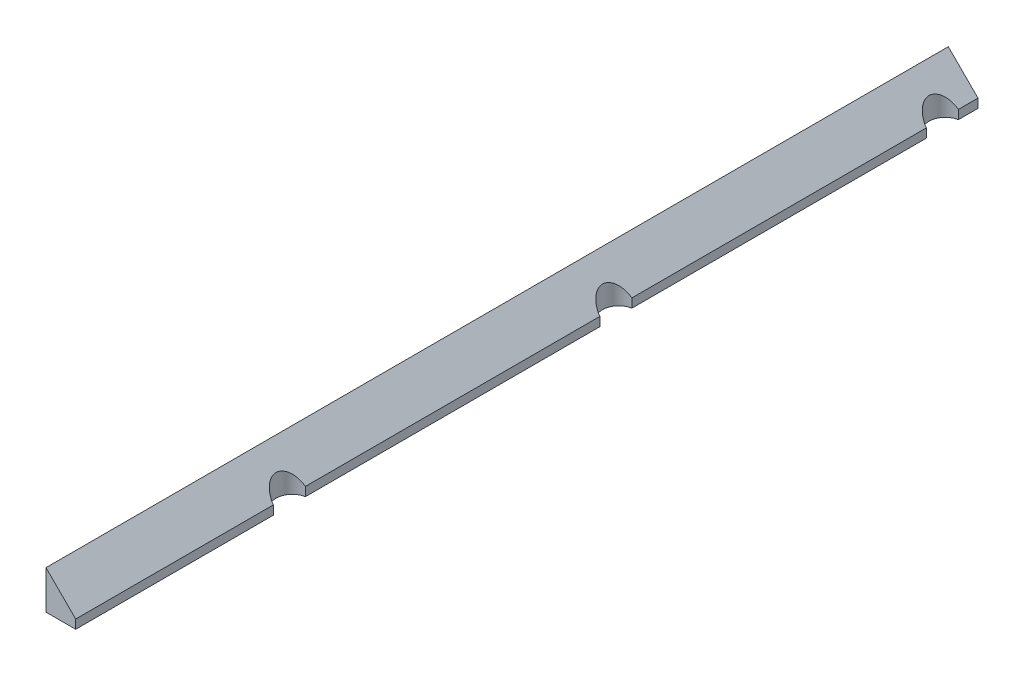
ISO-10303-21;
HEADER;
FILE_DESCRIPTION(('STEP AP214'),'2;1');
FILE_NAME('part.step','',(''),(''),'','','');
FILE_SCHEMA(('AUTOMOTIVE_DESIGN { 1 0 10303 214 1 1 1 1 }'));
ENDSEC;
DATA;
#1=APPLICATION_CONTEXT('core data for automotive mechanical design processes');
#2=APPLICATION_PROTOCOL_DEFINITION('international standard','automotive_design',2000,#1);
#3=PRODUCT_CONTEXT('',#1,'mechanical');
#4=PRODUCT('Part','Part','',(#3));
#5=PRODUCT_RELATED_PRODUCT_CATEGORY('part','',(#4));
#6=PRODUCT_DEFINITION_FORMATION('','',#4);
#7=PRODUCT_DEFINITION_CONTEXT('part definition',#1,'design');
#8=PRODUCT_DEFINITION('design','',#6,#7);
#9=PRODUCT_DEFINITION_SHAPE('','',#8);
#10=(LENGTH_UNIT() NAMED_UNIT(*) SI_UNIT(.MILLI.,.METRE.));
#11=(NAMED_UNIT(*) PLANE_ANGLE_UNIT() SI_UNIT($,.RADIAN.));
#12=(NAMED_UNIT(*) SI_UNIT($,.STERADIAN.) SOLID_ANGLE_UNIT());
#13=UNCERTAINTY_MEASURE_WITH_UNIT(LENGTH_MEASURE(1.E-05),#10,'distance_accuracy_value','');
#14=(GEOMETRIC_REPRESENTATION_CONTEXT(3) GLOBAL_UNCERTAINTY_ASSIGNED_CONTEXT((#13)) GLOBAL_UNIT_ASSIGNED_CONTEXT((#10,
#11,#12)) REPRESENTATION_CONTEXT('',''));
#15=CARTESIAN_POINT('',(0.,0.,0.));
#16=DIRECTION('',(0.,0.,1.));
#17=DIRECTION('',(1.,0.,0.));
#18=AXIS2_PLACEMENT_3D('',#15,#16,#17);
#19=CARTESIAN_POINT('',(2.00000000000002,0.,-36.4));
#20=DIRECTION('',(1.,0.,0.));
#21=DIRECTION('',(0.,0.,-0.999999999999999));
#22=AXIS2_PLACEMENT_3D('',#19,#20,#21);
#23=PLANE('',#22);
#24=DIRECTION('',(0.,-1.,0.));
#25=VECTOR('',#24,1.);
#26=CARTESIAN_POINT('',(2.00000000000003,4.15563491861042,23.0816653826392));
#27=LINE('',#26,#25);
#28=CARTESIAN_POINT('',(2.00000000000003,0.600000000000003,23.0816653826392));
#29=VERTEX_POINT('',#28);
#30=CARTESIAN_POINT('',(2.00000000000004,0.,23.0816653826392));
#31=VERTEX_POINT('',#30);
#32=EDGE_CURVE('E11',#29,#31,#27,.T.);
#33=ORIENTED_EDGE('',*,*,#32,.F.);
#34=DIRECTION('',(0.,0.,0.999999999999999));
#35=VECTOR('',#34,1.);
#36=CARTESIAN_POINT('',(2.00000000000002,0.599999999999969,-36.4));
#37=LINE('',#36,#35);
#38=CARTESIAN_POINT('',(2.00000000000002,0.60000000000001,36.3999999999999));
#39=VERTEX_POINT('',#38);
#40=EDGE_CURVE('E151',#29,#39,#37,.T.);
#41=ORIENTED_EDGE('',*,*,#40,.T.);
#42=DIRECTION('',(0.,1.,0.));
#43=VECTOR('',#42,1.);
#44=CARTESIAN_POINT('',(2.00000000000004,0.,36.3999999999999));
#45=LINE('',#44,#43);
#46=CARTESIAN_POINT('',(2.00000000000004,0.,36.3999999999999));
#47=VERTEX_POINT('',#46);
#48=EDGE_CURVE('E196',#47,#39,#45,.T.);
#49=ORIENTED_EDGE('',*,*,#48,.F.);
#50=DIRECTION('',(0.,0.,0.999999999999999));
#51=VECTOR('',#50,1.);
#52=CARTESIAN_POINT('',(2.00000000000002,0.,-36.4));
#53=LINE('',#52,#51);
#54=EDGE_CURVE('E157',#31,#47,#53,.T.);
#55=ORIENTED_EDGE('',*,*,#54,.F.);
#56=EDGE_LOOP('',(#33,#41,#49,#55));
#57=FACE_BOUND('',#56,.T.);
#58=ADVANCED_FACE('F42',(#57),#23,.T.);
#59=DIRECTION('',(0.,-1.,0.));
#60=VECTOR('',#59,1.);
#61=CARTESIAN_POINT('',(2.00000000000002,4.15563491861039,-20.9183346173608));
#62=LINE('',#61,#60);
#63=CARTESIAN_POINT('',(2.00000000000002,0.599999999999983,-20.9183346173608));
#64=VERTEX_POINT('',#63);
#65=CARTESIAN_POINT('',(2.00000000000002,0.,-20.9183346173608));
#66=VERTEX_POINT('',#65);
#67=EDGE_CURVE('E167',#64,#66,#62,.T.);
#68=ORIENTED_EDGE('',*,*,#67,.F.);
#69=CARTESIAN_POINT('',(2.00000000000003,0.599999999999983,-1.08166538263919));
#70=VERTEX_POINT('',#69);
#71=EDGE_CURVE('E149',#64,#70,#37,.T.);
#72=ORIENTED_EDGE('',*,*,#71,.T.);
#73=DIRECTION('',(0.,-1.,0.));
#74=VECTOR('',#73,1.);
#75=CARTESIAN_POINT('',(2.00000000000002,4.1556349186104,-1.08166538263919));
#76=LINE('',#75,#74);
#77=CARTESIAN_POINT('',(2.00000000000003,0.,-1.08166538263919));
#78=VERTEX_POINT('',#77);
#79=EDGE_CURVE('E147',#78,#70,#76,.F.);
#80=ORIENTED_EDGE('',*,*,#79,.F.);
#81=EDGE_CURVE('E156',#66,#78,#53,.T.);
#82=ORIENTED_EDGE('',*,*,#81,.F.);
#83=EDGE_LOOP('',(#68,#72,#80,#82));
#84=FACE_BOUND('',#83,.T.);
#85=ADVANCED_FACE('F226',(#84),#23,.T.);
#86=DIRECTION('',(0.,-1.,0.));
#87=VECTOR('',#86,1.);
#88=CARTESIAN_POINT('',(2.00000000000003,4.15563491861042,20.9183346173608));
#89=LINE('',#88,#87);
#90=CARTESIAN_POINT('',(2.00000000000004,0.,20.9183346173608));
#91=VERTEX_POINT('',#90);
#92=CARTESIAN_POINT('',(2.00000000000003,0.600000000000003,20.9183346173608));
#93=VERTEX_POINT('',#92);
#94=EDGE_CURVE('E51',#91,#93,#89,.F.);
#95=ORIENTED_EDGE('',*,*,#94,.F.);
#96=CARTESIAN_POINT('',(2.00000000000003,0.,1.08166538263919));
#97=VERTEX_POINT('',#96);
#98=EDGE_CURVE('E213',#97,#91,#53,.T.);
#99=ORIENTED_EDGE('',*,*,#98,.F.);
#100=DIRECTION('',(0.,-1.,0.));
#101=VECTOR('',#100,1.);
#102=CARTESIAN_POINT('',(2.00000000000002,4.1556349186104,1.0816653826392));
#103=LINE('',#102,#101);
#104=CARTESIAN_POINT('',(2.00000000000003,0.599999999999989,1.08166538263919));
#105=VERTEX_POINT('',#104);
#106=EDGE_CURVE('E160',#105,#97,#103,.T.);
#107=ORIENTED_EDGE('',*,*,#106,.F.);
#108=EDGE_CURVE('E182',#105,#93,#37,.T.);
#109=ORIENTED_EDGE('',*,*,#108,.T.);
#110=EDGE_LOOP('',(#95,#99,#107,#109));
#111=FACE_BOUND('',#110,.T.);
#112=ADVANCED_FACE('F187',(#111),#23,.T.);
#113=CARTESIAN_POINT('',(0.,0.,-36.4));
#114=DIRECTION('',(0.,-1.,0.));
#115=DIRECTION('',(0.,0.,-0.999999999999999));
#116=AXIS2_PLACEMENT_3D('',#113,#114,#115);
#117=PLANE('',#116);
#118=DIRECTION('',(-1.,0.,0.));
#119=VECTOR('',#118,1.);
#120=CARTESIAN_POINT('',(2.00000000000002,0.,-24.4));
#121=LINE('',#120,#119);
#122=CARTESIAN_POINT('',(2.00000000000002,0.,-24.4));
#123=VERTEX_POINT('',#122);
#124=CARTESIAN_POINT('',(0.,0.,-24.4));
#125=VERTEX_POINT('',#124);
#126=EDGE_CURVE('E120',#123,#125,#121,.T.);
#127=ORIENTED_EDGE('',*,*,#126,.F.);
#128=CARTESIAN_POINT('',(2.00000000000002,0.,-23.0816653826392));
#129=VERTEX_POINT('',#128);
#130=EDGE_CURVE('E154',#123,#129,#53,.T.);
#131=ORIENTED_EDGE('',*,*,#130,.T.);
#132=CARTESIAN_POINT('',(2.20000000000001,0.,-22.));
#133=DIRECTION('',(0.,-1.,0.));
#134=DIRECTION('',(0.,0.,-0.999999999999999));
#135=AXIS2_PLACEMENT_3D('',#132,#133,#134);
#136=CIRCLE('',#135,1.1);
#137=EDGE_CURVE('E184',#66,#129,#136,.T.);
#138=ORIENTED_EDGE('',*,*,#137,.F.);
#139=ORIENTED_EDGE('',*,*,#81,.T.);
#140=CARTESIAN_POINT('',(2.20000000000002,0.,0.));
#141=DIRECTION('',(0.,-1.,0.));
#142=DIRECTION('',(0.,0.,-0.999999999999999));
#143=AXIS2_PLACEMENT_3D('',#140,#141,#142);
#144=CIRCLE('',#143,1.1);
#145=EDGE_CURVE('E221',#97,#78,#144,.T.);
#146=ORIENTED_EDGE('',*,*,#145,.F.);
#147=ORIENTED_EDGE('',*,*,#98,.T.);
#148=CARTESIAN_POINT('',(2.20000000000002,0.,22.));
#149=DIRECTION('',(0.,-1.,0.));
#150=DIRECTION('',(0.,0.,-0.999999999999999));
#151=AXIS2_PLACEMENT_3D('',#148,#149,#150);
#152=CIRCLE('',#151,1.1);
#153=EDGE_CURVE('E65',#31,#91,#152,.T.);
#154=ORIENTED_EDGE('',*,*,#153,.F.);
#155=ORIENTED_EDGE('',*,*,#54,.T.);
#156=DIRECTION('',(1.,0.,0.));
#157=VECTOR('',#156,1.);
#158=CARTESIAN_POINT('',(0.,0.,36.3999999999999));
#159=LINE('',#158,#157);
#160=CARTESIAN_POINT('',(0.,0.,36.3999999999999));
#161=VERTEX_POINT('',#160);
#162=EDGE_CURVE('E204',#161,#47,#159,.T.);
#163=ORIENTED_EDGE('',*,*,#162,.F.);
#164=DIRECTION('',(0.,0.,0.999999999999999));
#165=VECTOR('',#164,1.);
#166=CARTESIAN_POINT('',(0.,0.,-36.4));
#167=LINE('',#166,#165);
#168=EDGE_CURVE('E142',#125,#161,#167,.T.);
#169=ORIENTED_EDGE('',*,*,#168,.F.);
#170=EDGE_LOOP('',(#127,#131,#138,#139,#146,#147,#154,#155,#163,#169));
#171=FACE_BOUND('',#170,.T.);
#172=ADVANCED_FACE('F44',(#171),#117,.T.);
#173=CARTESIAN_POINT('',(0.,0.,-36.4));
#174=DIRECTION('',(-1.,0.,0.));
#175=DIRECTION('',(0.,0.,0.999999999999999));
#176=AXIS2_PLACEMENT_3D('',#173,#174,#175);
#177=PLANE('',#176);
#178=DIRECTION('',(0.,-1.,0.));
#179=VECTOR('',#178,1.);
#180=CARTESIAN_POINT('',(0.,2.60000000000001,-24.4));
#181=LINE('',#180,#179);
#182=CARTESIAN_POINT('',(0.,2.60000000000001,-24.4));
#183=VERTEX_POINT('',#182);
#184=EDGE_CURVE('E117',#183,#125,#181,.T.);
#185=ORIENTED_EDGE('',*,*,#184,.T.);
#186=ORIENTED_EDGE('',*,*,#168,.T.);
#187=DIRECTION('',(0.,-1.,0.));
#188=VECTOR('',#187,1.);
#189=CARTESIAN_POINT('',(0.,0.,36.3999999999999));
#190=LINE('',#189,#188);
#191=CARTESIAN_POINT('',(0.,2.60000000000005,36.3999999999999));
#192=VERTEX_POINT('',#191);
#193=EDGE_CURVE('E140',#192,#161,#190,.T.);
#194=ORIENTED_EDGE('',*,*,#193,.F.);
#195=DIRECTION('',(0.,0.,0.999999999999999));
#196=VECTOR('',#195,1.);
#197=CARTESIAN_POINT('',(0.,2.6,-36.4));
#198=LINE('',#197,#196);
#199=EDGE_CURVE('E131',#183,#192,#198,.T.);
#200=ORIENTED_EDGE('',*,*,#199,.F.);
#201=EDGE_LOOP('',(#185,#186,#194,#200));
#202=FACE_BOUND('',#201,.T.);
#203=ADVANCED_FACE('F138',(#202),#177,.T.);
#204=CARTESIAN_POINT('',(1.29999999999999,1.29999999999998,-36.4));
#205=DIRECTION('',(0.707106781186547,0.707106781186547,0.));
#206=DIRECTION('',(-0.707106781186547,0.707106781186548,0.));
#207=AXIS2_PLACEMENT_3D('',#204,#205,#206);
#208=PLANE('',#207);
#209=DIRECTION('',(0.707106781186547,-0.707106781186548,0.));
#210=VECTOR('',#209,1.);
#211=CARTESIAN_POINT('',(1.3,1.3,-24.4));
#212=LINE('',#211,#210);
#213=CARTESIAN_POINT('',(2.00000000000002,0.599999999999969,-24.4));
#214=VERTEX_POINT('',#213);
#215=EDGE_CURVE('E58',#183,#214,#212,.T.);
#216=ORIENTED_EDGE('',*,*,#215,.F.);
#217=ORIENTED_EDGE('',*,*,#199,.T.);
#218=DIRECTION('',(-0.707106781186547,0.707106781186548,0.));
#219=VECTOR('',#218,1.);
#220=CARTESIAN_POINT('',(1.30000000000001,1.30000000000003,36.3999999999999));
#221=LINE('',#220,#219);
#222=EDGE_CURVE('E198',#39,#192,#221,.T.);
#223=ORIENTED_EDGE('',*,*,#222,.F.);
#224=ORIENTED_EDGE('',*,*,#40,.F.);
#225=CARTESIAN_POINT('',(2.20000000000004,0.400000000000005,22.));
#226=DIRECTION('',(0.707106781186547,0.707106781186547,0.));
#227=DIRECTION('',(0.707106781186547,-0.707106781186548,0.));
#228=AXIS2_PLACEMENT_3D('',#225,#226,#227);
#229=ELLIPSE('',#228,1.5556349186104,1.1);
#230=EDGE_CURVE('E173',#29,#93,#229,.F.);
#231=ORIENTED_EDGE('',*,*,#230,.T.);
#232=ORIENTED_EDGE('',*,*,#108,.F.);
#233=CARTESIAN_POINT('',(2.20000000000002,0.399999999999984,0.));
#234=DIRECTION('',(0.707106781186547,0.707106781186547,0.));
#235=DIRECTION('',(0.707106781186547,-0.707106781186548,0.));
#236=AXIS2_PLACEMENT_3D('',#233,#234,#235);
#237=ELLIPSE('',#236,1.5556349186104,1.1);
#238=EDGE_CURVE('E208',#105,#70,#237,.F.);
#239=ORIENTED_EDGE('',*,*,#238,.T.);
#240=ORIENTED_EDGE('',*,*,#71,.F.);
#241=CARTESIAN_POINT('',(2.20000000000001,0.39999999999997,-22.));
#242=DIRECTION('',(0.707106781186547,0.707106781186547,0.));
#243=DIRECTION('',(0.707106781186547,-0.707106781186548,0.));
#244=AXIS2_PLACEMENT_3D('',#241,#242,#243);
#245=ELLIPSE('',#244,1.5556349186104,1.1);
#246=CARTESIAN_POINT('',(2.00000000000002,0.599999999999969,-23.0816653826392));
#247=VERTEX_POINT('',#246);
#248=EDGE_CURVE('E234',#64,#247,#245,.F.);
#249=ORIENTED_EDGE('',*,*,#248,.T.);
#250=EDGE_CURVE('E134',#214,#247,#37,.T.);
#251=ORIENTED_EDGE('',*,*,#250,.F.);
#252=EDGE_LOOP('',(#216,#217,#223,#224,#231,#232,#239,#240,#249,#251));
#253=FACE_BOUND('',#252,.T.);
#254=ADVANCED_FACE('F129',(#253),#208,.T.);
#255=DIRECTION('',(0.,-1.,0.));
#256=VECTOR('',#255,1.);
#257=CARTESIAN_POINT('',(2.00000000000002,2.6,-24.4));
#258=LINE('',#257,#256);
#259=EDGE_CURVE('E125',#214,#123,#258,.T.);
#260=ORIENTED_EDGE('',*,*,#259,.F.);
#261=ORIENTED_EDGE('',*,*,#250,.T.);
#262=DIRECTION('',(0.,-1.,0.));
#263=VECTOR('',#262,1.);
#264=CARTESIAN_POINT('',(2.00000000000002,4.15563491861038,-23.0816653826392));
#265=LINE('',#264,#263);
#266=EDGE_CURVE('E163',#129,#247,#265,.F.);
#267=ORIENTED_EDGE('',*,*,#266,.F.);
#268=ORIENTED_EDGE('',*,*,#130,.F.);
#269=EDGE_LOOP('',(#260,#261,#267,#268));
#270=FACE_BOUND('',#269,.T.);
#271=ADVANCED_FACE('F246',(#270),#23,.T.);
#272=CARTESIAN_POINT('',(0.,0.,36.3999999999999));
#273=DIRECTION('',(0.,0.,0.999999999999999));
#274=DIRECTION('',(1.,0.,0.));
#275=AXIS2_PLACEMENT_3D('',#272,#273,#274);
#276=PLANE('',#275);
#277=ORIENTED_EDGE('',*,*,#162,.T.);
#278=ORIENTED_EDGE('',*,*,#48,.T.);
#279=ORIENTED_EDGE('',*,*,#222,.T.);
#280=ORIENTED_EDGE('',*,*,#193,.T.);
#281=EDGE_LOOP('',(#277,#278,#279,#280));
#282=FACE_BOUND('',#281,.T.);
#283=ADVANCED_FACE('F202',(#282),#276,.T.);
#284=CARTESIAN_POINT('',(2.20000000000002,4.1556349186104,0.));
#285=DIRECTION('',(0.,-1.,0.));
#286=DIRECTION('',(0.,0.,-0.999999999999999));
#287=AXIS2_PLACEMENT_3D('',#284,#285,#286);
#288=CYLINDRICAL_SURFACE('',#287,1.1);
#289=ORIENTED_EDGE('',*,*,#106,.T.);
#290=ORIENTED_EDGE('',*,*,#145,.T.);
#291=ORIENTED_EDGE('',*,*,#79,.T.);
#292=ORIENTED_EDGE('',*,*,#238,.F.);
#293=EDGE_LOOP('',(#289,#290,#291,#292));
#294=FACE_BOUND('',#293,.T.);
#295=ADVANCED_FACE('F229',(#294),#288,.F.);
#296=CARTESIAN_POINT('',(2.19999999999999,4.15563491861039,-22.));
#297=DIRECTION('',(0.,-1.,0.));
#298=DIRECTION('',(0.,0.,-0.999999999999999));
#299=AXIS2_PLACEMENT_3D('',#296,#297,#298);
#300=CYLINDRICAL_SURFACE('',#299,1.1);
#301=ORIENTED_EDGE('',*,*,#67,.T.);
#302=ORIENTED_EDGE('',*,*,#137,.T.);
#303=ORIENTED_EDGE('',*,*,#266,.T.);
#304=ORIENTED_EDGE('',*,*,#248,.F.);
#305=EDGE_LOOP('',(#301,#302,#303,#304));
#306=FACE_BOUND('',#305,.T.);
#307=ADVANCED_FACE('F248',(#306),#300,.F.);
#308=CARTESIAN_POINT('',(2.20000000000004,4.15563491861042,22.));
#309=DIRECTION('',(0.,-1.,0.));
#310=DIRECTION('',(0.,0.,-0.999999999999999));
#311=AXIS2_PLACEMENT_3D('',#308,#309,#310);
#312=CYLINDRICAL_SURFACE('',#311,1.1);
#313=ORIENTED_EDGE('',*,*,#32,.T.);
#314=ORIENTED_EDGE('',*,*,#153,.T.);
#315=ORIENTED_EDGE('',*,*,#94,.T.);
#316=ORIENTED_EDGE('',*,*,#230,.F.);
#317=EDGE_LOOP('',(#313,#314,#315,#316));
#318=FACE_BOUND('',#317,.T.);
#319=ADVANCED_FACE('F172',(#318),#312,.F.);
#320=CARTESIAN_POINT('',(2.00000000000002,2.6,-24.4));
#321=DIRECTION('',(0.,0.,0.999999999999999));
#322=DIRECTION('',(1.,0.,0.));
#323=AXIS2_PLACEMENT_3D('',#320,#321,#322);
#324=PLANE('',#323);
#325=ORIENTED_EDGE('',*,*,#215,.T.);
#326=ORIENTED_EDGE('',*,*,#259,.T.);
#327=ORIENTED_EDGE('',*,*,#126,.T.);
#328=ORIENTED_EDGE('',*,*,#184,.F.);
#329=EDGE_LOOP('',(#325,#326,#327,#328));
#330=FACE_BOUND('',#329,.T.);
#331=ADVANCED_FACE('F118',(#330),#324,.F.);
#332=CLOSED_SHELL('',(#58,#85,#112,#172,#203,#254,#271,#283,#295,#307,#319,#331));
#333=MANIFOLD_SOLID_BREP('B2',#332);
#334=ADVANCED_BREP_SHAPE_REPRESENTATION('',(#18,#333),#14);
#335=SHAPE_DEFINITION_REPRESENTATION(#9,#334);
ENDSEC;
END-ISO-10303-21;
